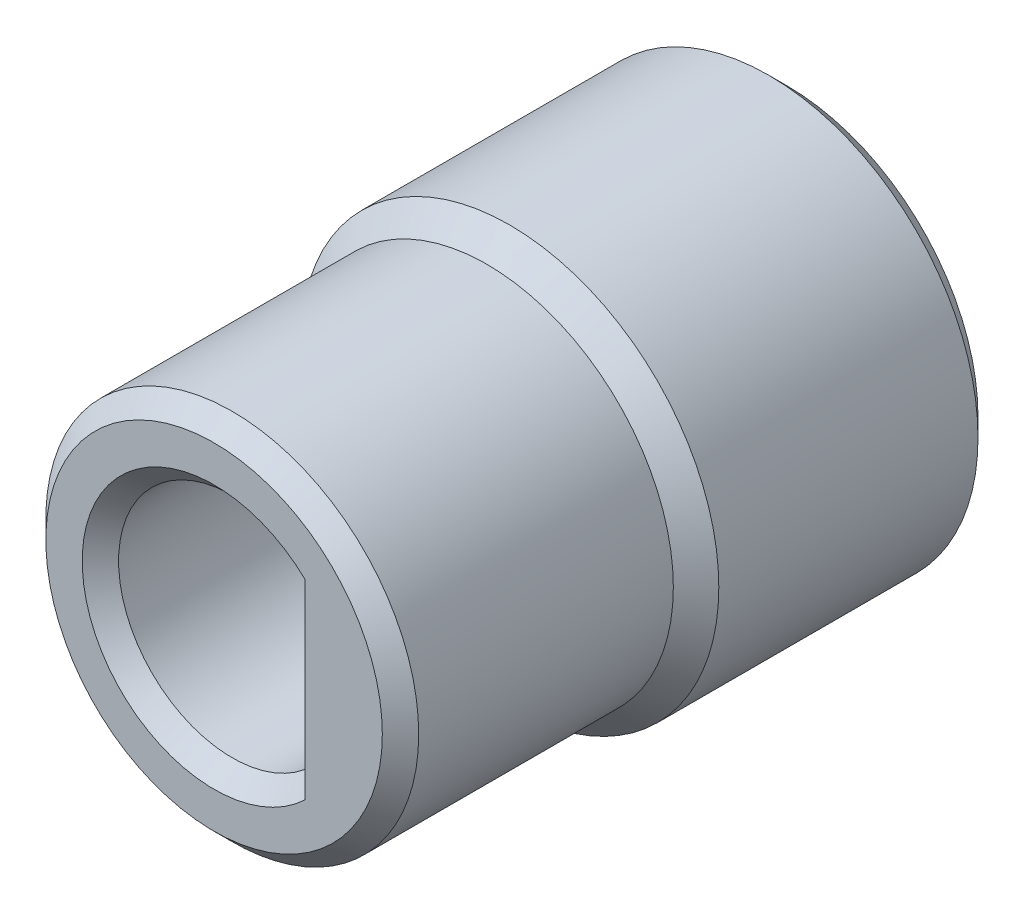
ISO-10303-21;
HEADER;
FILE_DESCRIPTION(('STEP AP214'),'2;1');
FILE_NAME('part.step','',(''),(''),'','','');
FILE_SCHEMA(('AUTOMOTIVE_DESIGN { 1 0 10303 214 1 1 1 1 }'));
ENDSEC;
DATA;
#1=APPLICATION_CONTEXT('core data for automotive mechanical design processes');
#2=APPLICATION_PROTOCOL_DEFINITION('international standard','automotive_design',2000,#1);
#3=PRODUCT_CONTEXT('',#1,'mechanical');
#4=PRODUCT('Part','Part','',(#3));
#5=PRODUCT_RELATED_PRODUCT_CATEGORY('part','',(#4));
#6=PRODUCT_DEFINITION_FORMATION('','',#4);
#7=PRODUCT_DEFINITION_CONTEXT('part definition',#1,'design');
#8=PRODUCT_DEFINITION('design','',#6,#7);
#9=PRODUCT_DEFINITION_SHAPE('','',#8);
#10=(LENGTH_UNIT() NAMED_UNIT(*) SI_UNIT(.MILLI.,.METRE.));
#11=(NAMED_UNIT(*) PLANE_ANGLE_UNIT() SI_UNIT($,.RADIAN.));
#12=(NAMED_UNIT(*) SI_UNIT($,.STERADIAN.) SOLID_ANGLE_UNIT());
#13=UNCERTAINTY_MEASURE_WITH_UNIT(LENGTH_MEASURE(1.E-05),#10,'distance_accuracy_value','');
#14=(GEOMETRIC_REPRESENTATION_CONTEXT(3) GLOBAL_UNCERTAINTY_ASSIGNED_CONTEXT((#13)) GLOBAL_UNIT_ASSIGNED_CONTEXT((#10,
#11,#12)) REPRESENTATION_CONTEXT('',''));
#15=CARTESIAN_POINT('',(0.,0.,0.));
#16=DIRECTION('',(0.,0.,1.));
#17=DIRECTION('',(1.,0.,0.));
#18=AXIS2_PLACEMENT_3D('',#15,#16,#17);
#19=CARTESIAN_POINT('',(0.,0.,0.));
#20=DIRECTION('',(0.,0.,1.));
#21=DIRECTION('',(1.,0.,0.));
#22=AXIS2_PLACEMENT_3D('',#19,#20,#21);
#23=PLANE('',#22);
#24=CARTESIAN_POINT('',(0.,0.,0.));
#25=DIRECTION('',(0.,0.,1.));
#26=DIRECTION('',(1.,0.,0.));
#27=AXIS2_PLACEMENT_3D('',#24,#25,#26);
#28=CIRCLE('',#27,4.2);
#29=CARTESIAN_POINT('',(4.2,0.,0.));
#30=VERTEX_POINT('',#29);
#31=EDGE_CURVE('E237',#30,#30,#28,.F.);
#32=ORIENTED_EDGE('',*,*,#31,.T.);
#33=EDGE_LOOP('',(#32));
#34=FACE_BOUND('',#33,.T.);
#35=CARTESIAN_POINT('',(0.,0.,0.));
#36=DIRECTION('',(0.,0.,1.));
#37=DIRECTION('',(1.,0.,0.));
#38=AXIS2_PLACEMENT_3D('',#35,#36,#37);
#39=CIRCLE('',#38,3.4);
#40=CARTESIAN_POINT('',(-3.4,0.,0.));
#41=VERTEX_POINT('',#40);
#42=EDGE_CURVE('E128',#41,#41,#39,.T.);
#43=ORIENTED_EDGE('',*,*,#42,.T.);
#44=EDGE_LOOP('',(#43));
#45=FACE_BOUND('',#44,.T.);
#46=ADVANCED_FACE('F45',(#34,#45),#23,.F.);
#47=CARTESIAN_POINT('',(0.,0.,6.6));
#48=DIRECTION('',(0.,0.,-1.));
#49=DIRECTION('',(-1.,0.,0.));
#50=AXIS2_PLACEMENT_3D('',#47,#48,#49);
#51=CYLINDRICAL_SURFACE('',#50,4.6);
#52=CARTESIAN_POINT('',(0.,0.,0.399999999999999));
#53=DIRECTION('',(0.,0.,1.));
#54=DIRECTION('',(1.,0.,0.));
#55=AXIS2_PLACEMENT_3D('',#52,#53,#54);
#56=CIRCLE('',#55,4.6);
#57=CARTESIAN_POINT('',(4.6,0.,0.399999999999999));
#58=VERTEX_POINT('',#57);
#59=EDGE_CURVE('E239',#58,#58,#56,.T.);
#60=ORIENTED_EDGE('',*,*,#59,.T.);
#61=EDGE_LOOP('',(#60));
#62=FACE_BOUND('',#61,.T.);
#63=CARTESIAN_POINT('',(0.,0.,6.1));
#64=DIRECTION('',(0.,0.,1.));
#65=DIRECTION('',(1.,0.,0.));
#66=AXIS2_PLACEMENT_3D('',#63,#64,#65);
#67=CIRCLE('',#66,4.6);
#68=CARTESIAN_POINT('',(4.6,0.,6.1));
#69=VERTEX_POINT('',#68);
#70=EDGE_CURVE('E114',#69,#69,#67,.F.);
#71=ORIENTED_EDGE('',*,*,#70,.T.);
#72=EDGE_LOOP('',(#71));
#73=FACE_BOUND('',#72,.T.);
#74=ADVANCED_FACE('F190',(#62,#73),#51,.T.);
#75=CARTESIAN_POINT('',(0.,0.,6.6));
#76=DIRECTION('',(0.,0.,-1.));
#77=DIRECTION('',(-1.,0.,0.));
#78=AXIS2_PLACEMENT_3D('',#75,#76,#77);
#79=CYLINDRICAL_SURFACE('',#78,3.);
#80=CARTESIAN_POINT('',(0.,0.,5.8));
#81=DIRECTION('',(0.,0.,1.));
#82=DIRECTION('',(1.,0.,0.));
#83=AXIS2_PLACEMENT_3D('',#80,#81,#82);
#84=CIRCLE('',#83,3.);
#85=CARTESIAN_POINT('',(-3.,0.,5.8));
#86=VERTEX_POINT('',#85);
#87=EDGE_CURVE('E136',#86,#86,#84,.T.);
#88=CARTESIAN_POINT('',(0.,0.,0.399999999999999));
#89=DIRECTION('',(0.,0.,1.));
#90=DIRECTION('',(1.,0.,0.));
#91=AXIS2_PLACEMENT_3D('',#88,#89,#90);
#92=CIRCLE('',#91,3.);
#93=CARTESIAN_POINT('',(-3.,0.,0.399999999999999));
#94=VERTEX_POINT('',#93);
#95=EDGE_CURVE('E132',#94,#94,#92,.F.);
#96=CARTESIAN_POINT('',(-3.,0.,5.8));
#97=CARTESIAN_POINT('',(-3.,0.,5.74375));
#98=CARTESIAN_POINT('',(-3.,0.,5.6875));
#99=CARTESIAN_POINT('',(-3.,0.,5.575));
#100=CARTESIAN_POINT('',(-3.,0.,5.51875));
#101=CARTESIAN_POINT('',(-3.,0.,5.40625));
#102=CARTESIAN_POINT('',(-3.,0.,5.35));
#103=CARTESIAN_POINT('',(-3.,0.,5.2375));
#104=CARTESIAN_POINT('',(-3.,0.,5.18125));
#105=CARTESIAN_POINT('',(-3.,0.,5.06875));
#106=CARTESIAN_POINT('',(-3.,0.,5.0125));
#107=CARTESIAN_POINT('',(-3.,0.,4.9));
#108=CARTESIAN_POINT('',(-3.,0.,4.84375));
#109=CARTESIAN_POINT('',(-3.,0.,4.73125));
#110=CARTESIAN_POINT('',(-3.,0.,4.675));
#111=CARTESIAN_POINT('',(-3.,0.,4.5625));
#112=CARTESIAN_POINT('',(-3.,0.,4.50625));
#113=CARTESIAN_POINT('',(-3.,0.,4.39375));
#114=CARTESIAN_POINT('',(-3.,0.,4.3375));
#115=CARTESIAN_POINT('',(-3.,0.,4.225));
#116=CARTESIAN_POINT('',(-3.,0.,4.16875));
#117=CARTESIAN_POINT('',(-3.,0.,4.05625));
#118=CARTESIAN_POINT('',(-3.,0.,4.));
#119=CARTESIAN_POINT('',(-3.,0.,3.8875));
#120=CARTESIAN_POINT('',(-3.,0.,3.83125));
#121=CARTESIAN_POINT('',(-3.,0.,3.71875));
#122=CARTESIAN_POINT('',(-3.,0.,3.6625));
#123=CARTESIAN_POINT('',(-3.,0.,3.55));
#124=CARTESIAN_POINT('',(-3.,0.,3.49375));
#125=CARTESIAN_POINT('',(-3.,0.,3.38125));
#126=CARTESIAN_POINT('',(-3.,0.,3.325));
#127=CARTESIAN_POINT('',(-3.,0.,3.2125));
#128=CARTESIAN_POINT('',(-3.,0.,3.15625));
#129=CARTESIAN_POINT('',(-3.,0.,3.04375));
#130=CARTESIAN_POINT('',(-3.,0.,2.9875));
#131=CARTESIAN_POINT('',(-3.,0.,2.875));
#132=CARTESIAN_POINT('',(-3.,0.,2.81875));
#133=CARTESIAN_POINT('',(-3.,0.,2.70625));
#134=CARTESIAN_POINT('',(-3.,0.,2.65));
#135=CARTESIAN_POINT('',(-3.,0.,2.5375));
#136=CARTESIAN_POINT('',(-3.,0.,2.48125));
#137=CARTESIAN_POINT('',(-3.,0.,2.36875));
#138=CARTESIAN_POINT('',(-3.,0.,2.3125));
#139=CARTESIAN_POINT('',(-3.,0.,2.2));
#140=CARTESIAN_POINT('',(-3.,0.,2.14375));
#141=CARTESIAN_POINT('',(-3.,0.,2.03125));
#142=CARTESIAN_POINT('',(-3.,0.,1.975));
#143=CARTESIAN_POINT('',(-3.,0.,1.8625));
#144=CARTESIAN_POINT('',(-3.,0.,1.80625));
#145=CARTESIAN_POINT('',(-3.,0.,1.69375));
#146=CARTESIAN_POINT('',(-3.,0.,1.6375));
#147=CARTESIAN_POINT('',(-3.,0.,1.525));
#148=CARTESIAN_POINT('',(-3.,0.,1.46875));
#149=CARTESIAN_POINT('',(-3.,0.,1.35625));
#150=CARTESIAN_POINT('',(-3.,0.,1.3));
#151=CARTESIAN_POINT('',(-3.,0.,1.1875));
#152=CARTESIAN_POINT('',(-3.,0.,1.13125));
#153=CARTESIAN_POINT('',(-3.,0.,1.01875));
#154=CARTESIAN_POINT('',(-3.,0.,0.962499999999999));
#155=CARTESIAN_POINT('',(-3.,0.,0.85));
#156=CARTESIAN_POINT('',(-3.,0.,0.79375));
#157=CARTESIAN_POINT('',(-3.,0.,0.68125));
#158=CARTESIAN_POINT('',(-3.,0.,0.625));
#159=CARTESIAN_POINT('',(-3.,0.,0.5125));
#160=CARTESIAN_POINT('',(-3.,0.,0.456249999999999));
#161=CARTESIAN_POINT('',(-3.,0.,0.399999999999999));
#162=B_SPLINE_CURVE_WITH_KNOTS('',3,(#96,#97,#98,#99,#100,#101,#102,#103,#104,#105,#106,#107,
#108,#109,#110,#111,#112,#113,#114,#115,#116,#117,#118,#119,#120,#121,#122,#123,#124,#125,#126,
#127,#128,#129,#130,#131,#132,#133,#134,#135,#136,#137,#138,#139,#140,#141,#142,#143,#144,#145,
#146,#147,#148,#149,#150,#151,#152,#153,#154,#155,#156,#157,#158,#159,#160,#161),.UNSPECIFIED.,
.F.,.F.,(4,2,2,2,2,2,2,2,2,2,2,2,2,2,2,2,2,2,2,2,2,2,2,2,2,2,2,2,2,2,2,2,4),(0.,0.16875,
0.337499999999999,0.50625,0.675,0.84375,1.0125,1.18125,1.35,1.51875,1.6875,1.85625,2.025,
2.19375,2.3625,2.53125,2.7,2.86875,3.0375,3.20625,3.375,3.54375,3.7125,3.88125,4.05,4.21875,
4.3875,4.55625,4.725,4.89375,5.0625,5.23125,5.4),.UNSPECIFIED.);
#163=EDGE_CURVE('BSEAM196',#86,#94,#162,.T.);
#164=ORIENTED_EDGE('',*,*,#87,.T.);
#165=ORIENTED_EDGE('',*,*,#95,.T.);
#166=ORIENTED_EDGE('',*,*,#163,.T.);
#167=ORIENTED_EDGE('',*,*,#163,.F.);
#168=EDGE_LOOP('',(#164,#166,#165,#167));
#169=FACE_BOUND('',#168,.T.);
#170=ADVANCED_FACE('F196',(#169),#79,.F.);
#171=CARTESIAN_POINT('',(0.,0.,12.6));
#172=DIRECTION('',(0.,0.,1.));
#173=DIRECTION('',(1.,0.,0.));
#174=AXIS2_PLACEMENT_3D('',#171,#172,#173);
#175=PLANE('',#174);
#176=CARTESIAN_POINT('',(0.,0.,12.6));
#177=DIRECTION('',(0.,0.,1.));
#178=DIRECTION('',(1.,0.,0.));
#179=AXIS2_PLACEMENT_3D('',#176,#177,#178);
#180=CIRCLE('',#179,3.7);
#181=CARTESIAN_POINT('',(3.7,0.,12.6));
#182=VERTEX_POINT('',#181);
#183=EDGE_CURVE('E55',#182,#182,#180,.T.);
#184=ORIENTED_EDGE('',*,*,#183,.T.);
#185=EDGE_LOOP('',(#184));
#186=FACE_BOUND('',#185,.T.);
#187=DIRECTION('',(0.,-1.,0.));
#188=VECTOR('',#187,1.);
#189=CARTESIAN_POINT('',(2.,0.,12.6));
#190=LINE('',#189,#188);
#191=CARTESIAN_POINT('',(2.,2.1,12.6));
#192=VERTEX_POINT('',#191);
#193=CARTESIAN_POINT('',(2.,-2.1,12.6));
#194=VERTEX_POINT('',#193);
#195=EDGE_CURVE('E61',#192,#194,#190,.T.);
#196=ORIENTED_EDGE('',*,*,#195,.T.);
#197=CARTESIAN_POINT('',(0.,0.,12.6));
#198=DIRECTION('',(0.,0.,1.));
#199=DIRECTION('',(1.,0.,0.));
#200=AXIS2_PLACEMENT_3D('',#197,#198,#199);
#201=CIRCLE('',#200,2.9);
#202=EDGE_CURVE('E122',#194,#192,#201,.F.);
#203=ORIENTED_EDGE('',*,*,#202,.T.);
#204=EDGE_LOOP('',(#196,#203));
#205=FACE_BOUND('',#204,.T.);
#206=ADVANCED_FACE('F223',(#186,#205),#175,.T.);
#207=CARTESIAN_POINT('',(0.,0.,6.6));
#208=DIRECTION('',(0.,0.,1.));
#209=DIRECTION('',(1.,0.,0.));
#210=AXIS2_PLACEMENT_3D('',#207,#208,#209);
#211=PLANE('',#210);
#212=CARTESIAN_POINT('',(0.,0.,6.6));
#213=DIRECTION('',(0.,0.,1.));
#214=DIRECTION('',(1.,0.,0.));
#215=AXIS2_PLACEMENT_3D('',#212,#213,#214);
#216=CIRCLE('',#215,2.6);
#217=CARTESIAN_POINT('',(-2.6,0.,6.6));
#218=VERTEX_POINT('',#217);
#219=EDGE_CURVE('E245',#218,#218,#216,.F.);
#220=ORIENTED_EDGE('',*,*,#219,.T.);
#221=EDGE_LOOP('',(#220));
#222=FACE_BOUND('',#221,.T.);
#223=CARTESIAN_POINT('',(0.,0.,6.6));
#224=DIRECTION('',(0.,0.,1.));
#225=DIRECTION('',(1.,0.,0.));
#226=AXIS2_PLACEMENT_3D('',#223,#224,#225);
#227=CIRCLE('',#226,2.5);
#228=CARTESIAN_POINT('',(1.6,1.92093727122986,6.6));
#229=VERTEX_POINT('',#228);
#230=CARTESIAN_POINT('',(1.6,-1.92093727122986,6.6));
#231=VERTEX_POINT('',#230);
#232=EDGE_CURVE('E89',#229,#231,#227,.T.);
#233=ORIENTED_EDGE('',*,*,#232,.T.);
#234=DIRECTION('',(0.,1.,0.));
#235=VECTOR('',#234,1.);
#236=CARTESIAN_POINT('',(1.6,-1.92093727122986,6.6));
#237=LINE('',#236,#235);
#238=EDGE_CURVE('E97',#231,#229,#237,.T.);
#239=ORIENTED_EDGE('',*,*,#238,.T.);
#240=EDGE_LOOP('',(#233,#239));
#241=FACE_BOUND('',#240,.T.);
#242=ADVANCED_FACE('F102',(#222,#241),#211,.F.);
#243=CARTESIAN_POINT('',(0.,0.,12.6));
#244=DIRECTION('',(0.,0.,-1.));
#245=DIRECTION('',(-1.,0.,0.));
#246=AXIS2_PLACEMENT_3D('',#243,#244,#245);
#247=CYLINDRICAL_SURFACE('',#246,4.1);
#248=CARTESIAN_POINT('',(0.,0.,12.2));
#249=DIRECTION('',(0.,0.,1.));
#250=DIRECTION('',(1.,0.,0.));
#251=AXIS2_PLACEMENT_3D('',#248,#249,#250);
#252=CIRCLE('',#251,4.1);
#253=CARTESIAN_POINT('',(4.1,0.,12.2));
#254=VERTEX_POINT('',#253);
#255=EDGE_CURVE('E11',#254,#254,#252,.F.);
#256=ORIENTED_EDGE('',*,*,#255,.T.);
#257=EDGE_LOOP('',(#256));
#258=FACE_BOUND('',#257,.T.);
#259=CARTESIAN_POINT('',(0.,0.,6.6));
#260=DIRECTION('',(0.,0.,1.));
#261=DIRECTION('',(1.,0.,0.));
#262=AXIS2_PLACEMENT_3D('',#259,#260,#261);
#263=CIRCLE('',#262,4.1);
#264=CARTESIAN_POINT('',(4.1,0.,6.6));
#265=VERTEX_POINT('',#264);
#266=EDGE_CURVE('E94',#265,#265,#263,.T.);
#267=ORIENTED_EDGE('',*,*,#266,.T.);
#268=EDGE_LOOP('',(#267));
#269=FACE_BOUND('',#268,.T.);
#270=ADVANCED_FACE('F215',(#258,#269),#247,.T.);
#271=CARTESIAN_POINT('',(0.,0.,12.6));
#272=DIRECTION('',(0.,0.,-1.));
#273=DIRECTION('',(-1.,0.,0.));
#274=AXIS2_PLACEMENT_3D('',#271,#272,#273);
#275=CYLINDRICAL_SURFACE('',#274,2.5);
#276=DIRECTION('',(0.,0.,-1.));
#277=VECTOR('',#276,1.);
#278=CARTESIAN_POINT('',(1.6,1.92093727122986,12.6));
#279=LINE('',#278,#277);
#280=CARTESIAN_POINT('',(1.6,1.92093727122986,12.2));
#281=VERTEX_POINT('',#280);
#282=EDGE_CURVE('E95',#281,#229,#279,.T.);
#283=ORIENTED_EDGE('',*,*,#282,.F.);
#284=CARTESIAN_POINT('',(0.,0.,12.2));
#285=DIRECTION('',(0.,0.,1.));
#286=DIRECTION('',(1.,0.,0.));
#287=AXIS2_PLACEMENT_3D('',#284,#285,#286);
#288=CIRCLE('',#287,2.5);
#289=CARTESIAN_POINT('',(1.6,-1.92093727122986,12.2));
#290=VERTEX_POINT('',#289);
#291=EDGE_CURVE('E91',#281,#290,#288,.T.);
#292=ORIENTED_EDGE('',*,*,#291,.T.);
#293=DIRECTION('',(0.,0.,-1.));
#294=VECTOR('',#293,1.);
#295=CARTESIAN_POINT('',(1.6,-1.92093727122986,12.6));
#296=LINE('',#295,#294);
#297=EDGE_CURVE('E84',#290,#231,#296,.T.);
#298=ORIENTED_EDGE('',*,*,#297,.T.);
#299=ORIENTED_EDGE('',*,*,#232,.F.);
#300=EDGE_LOOP('',(#283,#292,#298,#299));
#301=FACE_BOUND('',#300,.T.);
#302=ADVANCED_FACE('F87',(#301),#275,.F.);
#303=CARTESIAN_POINT('',(1.6,-1.92093727122986,12.6));
#304=DIRECTION('',(-1.,0.,0.));
#305=DIRECTION('',(0.,0.,1.));
#306=AXIS2_PLACEMENT_3D('',#303,#304,#305);
#307=PLANE('',#306);
#308=ORIENTED_EDGE('',*,*,#297,.F.);
#309=DIRECTION('',(0.,1.,0.));
#310=VECTOR('',#309,1.);
#311=CARTESIAN_POINT('',(1.6,-1.92093727122986,12.2));
#312=LINE('',#311,#310);
#313=EDGE_CURVE('E125',#290,#281,#312,.T.);
#314=ORIENTED_EDGE('',*,*,#313,.T.);
#315=ORIENTED_EDGE('',*,*,#282,.T.);
#316=ORIENTED_EDGE('',*,*,#238,.F.);
#317=EDGE_LOOP('',(#308,#314,#315,#316));
#318=FACE_BOUND('',#317,.T.);
#319=ADVANCED_FACE('F98',(#318),#307,.T.);
#320=CARTESIAN_POINT('',(0.,0.,6.6));
#321=DIRECTION('',(0.,0.,-1.));
#322=DIRECTION('',(-1.,0.,0.));
#323=AXIS2_PLACEMENT_3D('',#320,#321,#322);
#324=CONICAL_SURFACE('',#323,4.1,0.785398163397445);
#325=ORIENTED_EDGE('',*,*,#70,.F.);
#326=EDGE_LOOP('',(#325));
#327=FACE_BOUND('',#326,.T.);
#328=ORIENTED_EDGE('',*,*,#266,.F.);
#329=EDGE_LOOP('',(#328));
#330=FACE_BOUND('',#329,.T.);
#331=ADVANCED_FACE('F161',(#327,#330),#324,.T.);
#332=CARTESIAN_POINT('',(1.6,-1.92093727122986,12.2));
#333=DIRECTION('',(0.707106781186546,0.,-0.707106781186549));
#334=DIRECTION('',(0.,1.,0.));
#335=AXIS2_PLACEMENT_3D('',#332,#333,#334);
#336=PLANE('',#335);
#337=CARTESIAN_POINT('',(1.6,-1.92093727122986,12.2));
#338=CARTESIAN_POINT('',(1.66639659829473,-1.95198864238736,12.2663965982947));
#339=CARTESIAN_POINT('',(1.73292833253178,-1.98243626556268,12.3329283325318));
#340=CARTESIAN_POINT('',(1.86626166750856,-2.04212383447698,12.4662616675086));
#341=CARTESIAN_POINT('',(1.93306326660484,-2.07136378755838,12.5330632666048));
#342=CARTESIAN_POINT('',(2.,-2.1,12.6));
#343=B_SPLINE_CURVE_WITH_KNOTS('',3,(#337,#338,#339,#340,#341,#342),.UNSPECIFIED.,.F.,.F.,(4,2,
4),(0.,0.296681663915824,0.593361523796096),.UNSPECIFIED.);
#344=EDGE_CURVE('E106',#194,#290,#343,.F.);
#345=ORIENTED_EDGE('',*,*,#344,.F.);
#346=ORIENTED_EDGE('',*,*,#195,.F.);
#347=CARTESIAN_POINT('',(2.,2.1,12.6));
#348=CARTESIAN_POINT('',(1.93306326660484,2.07136378755838,12.5330632666048));
#349=CARTESIAN_POINT('',(1.86626166750856,2.04212383447698,12.4662616675086));
#350=CARTESIAN_POINT('',(1.73292833253178,1.98243626556268,12.3329283325318));
#351=CARTESIAN_POINT('',(1.66639659829473,1.95198864238736,12.2663965982947));
#352=CARTESIAN_POINT('',(1.6,1.92093727122985,12.2));
#353=B_SPLINE_CURVE_WITH_KNOTS('',3,(#347,#348,#349,#350,#351,#352),.UNSPECIFIED.,.F.,.F.,(4,2,
4),(0.,0.296679859880272,0.593361523796097),.UNSPECIFIED.);
#354=EDGE_CURVE('E68',#281,#192,#353,.F.);
#355=ORIENTED_EDGE('',*,*,#354,.F.);
#356=ORIENTED_EDGE('',*,*,#313,.F.);
#357=EDGE_LOOP('',(#345,#346,#355,#356));
#358=FACE_BOUND('',#357,.T.);
#359=ADVANCED_FACE('F154',(#358),#336,.F.);
#360=CARTESIAN_POINT('',(0.,0.,12.2));
#361=DIRECTION('',(0.,0.,1.));
#362=DIRECTION('',(1.,0.,0.));
#363=AXIS2_PLACEMENT_3D('',#360,#361,#362);
#364=CONICAL_SURFACE('',#363,2.5,0.78539816339745);
#365=ORIENTED_EDGE('',*,*,#354,.T.);
#366=ORIENTED_EDGE('',*,*,#202,.F.);
#367=ORIENTED_EDGE('',*,*,#344,.T.);
#368=ORIENTED_EDGE('',*,*,#291,.F.);
#369=EDGE_LOOP('',(#365,#366,#367,#368));
#370=FACE_BOUND('',#369,.T.);
#371=ADVANCED_FACE('F150',(#370),#364,.F.);
#372=CARTESIAN_POINT('',(0.,0.,0.));
#373=DIRECTION('',(0.,0.,-1.));
#374=DIRECTION('',(-1.,0.,0.));
#375=AXIS2_PLACEMENT_3D('',#372,#373,#374);
#376=CONICAL_SURFACE('',#375,3.4,0.785398163397447);
#377=CARTESIAN_POINT('',(-3.,0.,0.399999999999999));
#378=CARTESIAN_POINT('',(-3.00416666666667,0.,0.395833333333333));
#379=CARTESIAN_POINT('',(-3.00833333333333,0.,0.391666666666666));
#380=CARTESIAN_POINT('',(-3.01666666666667,0.,0.383333333333333));
#381=CARTESIAN_POINT('',(-3.02083333333333,0.,0.379166666666666));
#382=CARTESIAN_POINT('',(-3.02916666666667,0.,0.370833333333333));
#383=CARTESIAN_POINT('',(-3.03333333333333,0.,0.366666666666666));
#384=CARTESIAN_POINT('',(-3.04166666666667,0.,0.358333333333333));
#385=CARTESIAN_POINT('',(-3.04583333333333,0.,0.354166666666666));
#386=CARTESIAN_POINT('',(-3.05416666666667,0.,0.345833333333333));
#387=CARTESIAN_POINT('',(-3.05833333333333,0.,0.341666666666666));
#388=CARTESIAN_POINT('',(-3.06666666666667,0.,0.333333333333333));
#389=CARTESIAN_POINT('',(-3.07083333333333,0.,0.329166666666666));
#390=CARTESIAN_POINT('',(-3.07916666666667,0.,0.320833333333333));
#391=CARTESIAN_POINT('',(-3.08333333333333,0.,0.316666666666666));
#392=CARTESIAN_POINT('',(-3.09166666666667,0.,0.308333333333333));
#393=CARTESIAN_POINT('',(-3.09583333333333,0.,0.304166666666666));
#394=CARTESIAN_POINT('',(-3.10416666666667,0.,0.295833333333333));
#395=CARTESIAN_POINT('',(-3.10833333333333,0.,0.291666666666666));
#396=CARTESIAN_POINT('',(-3.11666666666667,0.,0.283333333333333));
#397=CARTESIAN_POINT('',(-3.12083333333333,0.,0.279166666666666));
#398=CARTESIAN_POINT('',(-3.12916666666667,0.,0.270833333333333));
#399=CARTESIAN_POINT('',(-3.13333333333333,0.,0.266666666666666));
#400=CARTESIAN_POINT('',(-3.14166666666667,0.,0.258333333333333));
#401=CARTESIAN_POINT('',(-3.14583333333333,0.,0.254166666666666));
#402=CARTESIAN_POINT('',(-3.15416666666667,0.,0.245833333333333));
#403=CARTESIAN_POINT('',(-3.15833333333333,0.,0.241666666666666));
#404=CARTESIAN_POINT('',(-3.16666666666667,0.,0.233333333333333));
#405=CARTESIAN_POINT('',(-3.17083333333333,0.,0.229166666666666));
#406=CARTESIAN_POINT('',(-3.17916666666667,0.,0.220833333333333));
#407=CARTESIAN_POINT('',(-3.18333333333333,0.,0.216666666666666));
#408=CARTESIAN_POINT('',(-3.19166666666667,0.,0.208333333333333));
#409=CARTESIAN_POINT('',(-3.19583333333333,0.,0.204166666666666));
#410=CARTESIAN_POINT('',(-3.20416666666667,0.,0.195833333333333));
#411=CARTESIAN_POINT('',(-3.20833333333333,0.,0.191666666666666));
#412=CARTESIAN_POINT('',(-3.21666666666667,0.,0.183333333333333));
#413=CARTESIAN_POINT('',(-3.22083333333333,0.,0.179166666666666));
#414=CARTESIAN_POINT('',(-3.22916666666667,0.,0.170833333333333));
#415=CARTESIAN_POINT('',(-3.23333333333333,0.,0.166666666666666));
#416=CARTESIAN_POINT('',(-3.24166666666667,0.,0.158333333333333));
#417=CARTESIAN_POINT('',(-3.24583333333333,0.,0.154166666666666));
#418=CARTESIAN_POINT('',(-3.25416666666667,0.,0.145833333333333));
#419=CARTESIAN_POINT('',(-3.25833333333333,0.,0.141666666666666));
#420=CARTESIAN_POINT('',(-3.26666666666667,0.,0.133333333333333));
#421=CARTESIAN_POINT('',(-3.27083333333333,0.,0.129166666666666));
#422=CARTESIAN_POINT('',(-3.27916666666667,0.,0.120833333333333));
#423=CARTESIAN_POINT('',(-3.28333333333333,0.,0.116666666666666));
#424=CARTESIAN_POINT('',(-3.29166666666667,0.,0.108333333333333));
#425=CARTESIAN_POINT('',(-3.29583333333333,0.,0.104166666666666));
#426=CARTESIAN_POINT('',(-3.30416666666667,0.,0.0958333333333332));
#427=CARTESIAN_POINT('',(-3.30833333333333,0.,0.0916666666666665));
#428=CARTESIAN_POINT('',(-3.31666666666667,0.,0.0833333333333332));
#429=CARTESIAN_POINT('',(-3.32083333333333,0.,0.0791666666666665));
#430=CARTESIAN_POINT('',(-3.32916666666667,0.,0.0708333333333332));
#431=CARTESIAN_POINT('',(-3.33333333333333,0.,0.0666666666666665));
#432=CARTESIAN_POINT('',(-3.34166666666667,0.,0.0583333333333332));
#433=CARTESIAN_POINT('',(-3.34583333333333,0.,0.0541666666666666));
#434=CARTESIAN_POINT('',(-3.35416666666667,0.,0.0458333333333332));
#435=CARTESIAN_POINT('',(-3.35833333333333,0.,0.0416666666666666));
#436=CARTESIAN_POINT('',(-3.36666666666667,0.,0.0333333333333333));
#437=CARTESIAN_POINT('',(-3.37083333333333,0.,0.0291666666666666));
#438=CARTESIAN_POINT('',(-3.37916666666667,0.,0.0208333333333333));
#439=CARTESIAN_POINT('',(-3.38333333333333,0.,0.0166666666666666));
#440=CARTESIAN_POINT('',(-3.39166666666667,0.,0.00833333333333332));
#441=CARTESIAN_POINT('',(-3.39583333333333,0.,0.00416666666666666));
#442=CARTESIAN_POINT('',(-3.4,0.,0.));
#443=B_SPLINE_CURVE_WITH_KNOTS('',3,(#377,#378,#379,#380,#381,#382,#383,#384,#385,#386,#387,
#388,#389,#390,#391,#392,#393,#394,#395,#396,#397,#398,#399,#400,#401,#402,#403,#404,#405,#406,
#407,#408,#409,#410,#411,#412,#413,#414,#415,#416,#417,#418,#419,#420,#421,#422,#423,#424,#425,
#426,#427,#428,#429,#430,#431,#432,#433,#434,#435,#436,#437,#438,#439,#440,#441,#442),
.UNSPECIFIED.,.F.,.F.,(4,2,2,2,2,2,2,2,2,2,2,2,2,2,2,2,2,2,2,2,2,2,2,2,2,2,2,2,2,2,2,2,4),(0.,
0.0176776695296636,0.0353553390593272,0.0530330085889909,0.0707106781186545,0.0883883476483181,
0.106066017177982,0.123743686707645,0.141421356237309,0.159099025766973,0.176776695296636,
0.1944543648263,0.212132034355963,0.229809703885627,0.247487373415291,0.265165042944954,
0.282842712474618,0.300520382004282,0.318198051533945,0.335875721063609,0.353553390593273,
0.371231060122936,0.3889087296526,0.406586399182263,0.424264068711927,0.441941738241591,
0.459619407771254,0.477297077300918,0.494974746830582,0.512652416360245,0.530330085889909,
0.548007755419572,0.565685424949236),.UNSPECIFIED.);
#444=EDGE_CURVE('BSEAM164',#94,#41,#443,.T.);
#445=ORIENTED_EDGE('',*,*,#95,.F.);
#446=ORIENTED_EDGE('',*,*,#42,.F.);
#447=ORIENTED_EDGE('',*,*,#444,.T.);
#448=ORIENTED_EDGE('',*,*,#444,.F.);
#449=EDGE_LOOP('',(#445,#447,#446,#448));
#450=FACE_BOUND('',#449,.T.);
#451=ADVANCED_FACE('F164',(#450),#376,.F.);
#452=CARTESIAN_POINT('',(0.,0.,5.8));
#453=DIRECTION('',(0.,0.,-1.));
#454=DIRECTION('',(-1.,0.,0.));
#455=AXIS2_PLACEMENT_3D('',#452,#453,#454);
#456=CONICAL_SURFACE('',#455,3.,0.463647609000807);
#457=CARTESIAN_POINT('',(-2.6,0.,6.6));
#458=CARTESIAN_POINT('',(-2.60416666666667,0.,6.59166666666667));
#459=CARTESIAN_POINT('',(-2.60833333333333,0.,6.58333333333333));
#460=CARTESIAN_POINT('',(-2.61666666666667,0.,6.56666666666667));
#461=CARTESIAN_POINT('',(-2.62083333333333,0.,6.55833333333333));
#462=CARTESIAN_POINT('',(-2.62916666666667,0.,6.54166666666667));
#463=CARTESIAN_POINT('',(-2.63333333333333,0.,6.53333333333333));
#464=CARTESIAN_POINT('',(-2.64166666666667,0.,6.51666666666667));
#465=CARTESIAN_POINT('',(-2.64583333333333,0.,6.50833333333333));
#466=CARTESIAN_POINT('',(-2.65416666666667,0.,6.49166666666667));
#467=CARTESIAN_POINT('',(-2.65833333333333,0.,6.48333333333333));
#468=CARTESIAN_POINT('',(-2.66666666666667,0.,6.46666666666667));
#469=CARTESIAN_POINT('',(-2.67083333333333,0.,6.45833333333333));
#470=CARTESIAN_POINT('',(-2.67916666666667,0.,6.44166666666667));
#471=CARTESIAN_POINT('',(-2.68333333333333,0.,6.43333333333333));
#472=CARTESIAN_POINT('',(-2.69166666666667,0.,6.41666666666667));
#473=CARTESIAN_POINT('',(-2.69583333333333,0.,6.40833333333333));
#474=CARTESIAN_POINT('',(-2.70416666666667,0.,6.39166666666667));
#475=CARTESIAN_POINT('',(-2.70833333333333,0.,6.38333333333333));
#476=CARTESIAN_POINT('',(-2.71666666666667,0.,6.36666666666667));
#477=CARTESIAN_POINT('',(-2.72083333333333,0.,6.35833333333333));
#478=CARTESIAN_POINT('',(-2.72916666666667,0.,6.34166666666667));
#479=CARTESIAN_POINT('',(-2.73333333333333,0.,6.33333333333333));
#480=CARTESIAN_POINT('',(-2.74166666666667,0.,6.31666666666667));
#481=CARTESIAN_POINT('',(-2.74583333333333,0.,6.30833333333333));
#482=CARTESIAN_POINT('',(-2.75416666666667,0.,6.29166666666667));
#483=CARTESIAN_POINT('',(-2.75833333333333,0.,6.28333333333333));
#484=CARTESIAN_POINT('',(-2.76666666666667,0.,6.26666666666667));
#485=CARTESIAN_POINT('',(-2.77083333333333,0.,6.25833333333333));
#486=CARTESIAN_POINT('',(-2.77916666666667,0.,6.24166666666667));
#487=CARTESIAN_POINT('',(-2.78333333333333,0.,6.23333333333333));
#488=CARTESIAN_POINT('',(-2.79166666666667,0.,6.21666666666667));
#489=CARTESIAN_POINT('',(-2.79583333333333,0.,6.20833333333333));
#490=CARTESIAN_POINT('',(-2.80416666666667,0.,6.19166666666667));
#491=CARTESIAN_POINT('',(-2.80833333333333,0.,6.18333333333333));
#492=CARTESIAN_POINT('',(-2.81666666666667,0.,6.16666666666667));
#493=CARTESIAN_POINT('',(-2.82083333333333,0.,6.15833333333333));
#494=CARTESIAN_POINT('',(-2.82916666666667,0.,6.14166666666667));
#495=CARTESIAN_POINT('',(-2.83333333333333,0.,6.13333333333333));
#496=CARTESIAN_POINT('',(-2.84166666666667,0.,6.11666666666667));
#497=CARTESIAN_POINT('',(-2.84583333333333,0.,6.10833333333333));
#498=CARTESIAN_POINT('',(-2.85416666666667,0.,6.09166666666667));
#499=CARTESIAN_POINT('',(-2.85833333333333,0.,6.08333333333333));
#500=CARTESIAN_POINT('',(-2.86666666666667,0.,6.06666666666667));
#501=CARTESIAN_POINT('',(-2.87083333333333,0.,6.05833333333333));
#502=CARTESIAN_POINT('',(-2.87916666666667,0.,6.04166666666667));
#503=CARTESIAN_POINT('',(-2.88333333333333,0.,6.03333333333333));
#504=CARTESIAN_POINT('',(-2.89166666666667,0.,6.01666666666667));
#505=CARTESIAN_POINT('',(-2.89583333333333,0.,6.00833333333333));
#506=CARTESIAN_POINT('',(-2.90416666666667,0.,5.99166666666667));
#507=CARTESIAN_POINT('',(-2.90833333333333,0.,5.98333333333333));
#508=CARTESIAN_POINT('',(-2.91666666666667,0.,5.96666666666667));
#509=CARTESIAN_POINT('',(-2.92083333333333,0.,5.95833333333333));
#510=CARTESIAN_POINT('',(-2.92916666666667,0.,5.94166666666667));
#511=CARTESIAN_POINT('',(-2.93333333333333,0.,5.93333333333333));
#512=CARTESIAN_POINT('',(-2.94166666666667,0.,5.91666666666667));
#513=CARTESIAN_POINT('',(-2.94583333333333,0.,5.90833333333333));
#514=CARTESIAN_POINT('',(-2.95416666666667,0.,5.89166666666667));
#515=CARTESIAN_POINT('',(-2.95833333333333,0.,5.88333333333333));
#516=CARTESIAN_POINT('',(-2.96666666666667,0.,5.86666666666667));
#517=CARTESIAN_POINT('',(-2.97083333333333,0.,5.85833333333334));
#518=CARTESIAN_POINT('',(-2.97916666666667,0.,5.84166666666667));
#519=CARTESIAN_POINT('',(-2.98333333333333,0.,5.83333333333334));
#520=CARTESIAN_POINT('',(-2.99166666666667,0.,5.81666666666667));
#521=CARTESIAN_POINT('',(-2.99583333333333,0.,5.80833333333334));
#522=CARTESIAN_POINT('',(-3.,0.,5.8));
#523=B_SPLINE_CURVE_WITH_KNOTS('',3,(#457,#458,#459,#460,#461,#462,#463,#464,#465,#466,#467,
#468,#469,#470,#471,#472,#473,#474,#475,#476,#477,#478,#479,#480,#481,#482,#483,#484,#485,#486,
#487,#488,#489,#490,#491,#492,#493,#494,#495,#496,#497,#498,#499,#500,#501,#502,#503,#504,#505,
#506,#507,#508,#509,#510,#511,#512,#513,#514,#515,#516,#517,#518,#519,#520,#521,#522),
.UNSPECIFIED.,.F.,.F.,(4,2,2,2,2,2,2,2,2,2,2,2,2,2,2,2,2,2,2,2,2,2,2,2,2,2,2,2,2,2,2,2,4),(0.,
0.0279508497187474,0.0559016994374946,0.0838525491562418,0.111803398874989,0.139754248593736,
0.167705098312483,0.195655948031231,0.223606797749978,0.251557647468725,0.279508497187473,
0.30745934690622,0.335410196624968,0.363361046343715,0.391311896062462,0.419262745781209,
0.447213595499957,0.475164445218704,0.503115294937451,0.531066144656198,0.559016994374946,
0.586967844093694,0.614918693812441,0.642869543531188,0.670820393249935,0.698771242968682,
0.72672209268743,0.754672942406177,0.782623792124924,0.810574641843671,0.838525491562418,
0.866476341281166,0.894427190999913),.UNSPECIFIED.);
#524=EDGE_CURVE('BSEAM171',#218,#86,#523,.T.);
#525=ORIENTED_EDGE('',*,*,#219,.F.);
#526=ORIENTED_EDGE('',*,*,#87,.F.);
#527=ORIENTED_EDGE('',*,*,#524,.T.);
#528=ORIENTED_EDGE('',*,*,#524,.F.);
#529=EDGE_LOOP('',(#525,#527,#526,#528));
#530=FACE_BOUND('',#529,.T.);
#531=ADVANCED_FACE('F171',(#530),#456,.F.);
#532=CARTESIAN_POINT('',(0.,0.,0.399999999999999));
#533=DIRECTION('',(0.,0.,1.));
#534=DIRECTION('',(1.,0.,0.));
#535=AXIS2_PLACEMENT_3D('',#532,#533,#534);
#536=CONICAL_SURFACE('',#535,4.6,0.785398163397448);
#537=CARTESIAN_POINT('',(4.2,0.,0.));
#538=CARTESIAN_POINT('',(4.20416666666667,0.,0.00416666666666671));
#539=CARTESIAN_POINT('',(4.20833333333333,0.,0.00833333333333335));
#540=CARTESIAN_POINT('',(4.21666666666667,0.,0.0166666666666666));
#541=CARTESIAN_POINT('',(4.22083333333333,0.,0.0208333333333333));
#542=CARTESIAN_POINT('',(4.22916666666667,0.,0.0291666666666665));
#543=CARTESIAN_POINT('',(4.23333333333333,0.,0.0333333333333331));
#544=CARTESIAN_POINT('',(4.24166666666667,0.,0.0416666666666665));
#545=CARTESIAN_POINT('',(4.24583333333333,0.,0.0458333333333333));
#546=CARTESIAN_POINT('',(4.25416666666667,0.,0.0541666666666666));
#547=CARTESIAN_POINT('',(4.25833333333333,0.,0.0583333333333331));
#548=CARTESIAN_POINT('',(4.26666666666667,0.,0.0666666666666664));
#549=CARTESIAN_POINT('',(4.27083333333333,0.,0.0708333333333332));
#550=CARTESIAN_POINT('',(4.27916666666667,0.,0.0791666666666666));
#551=CARTESIAN_POINT('',(4.28333333333333,0.,0.0833333333333331));
#552=CARTESIAN_POINT('',(4.29166666666667,0.,0.0916666666666664));
#553=CARTESIAN_POINT('',(4.29583333333333,0.,0.0958333333333332));
#554=CARTESIAN_POINT('',(4.30416666666667,0.,0.104166666666667));
#555=CARTESIAN_POINT('',(4.30833333333333,0.,0.108333333333333));
#556=CARTESIAN_POINT('',(4.31666666666667,0.,0.116666666666666));
#557=CARTESIAN_POINT('',(4.32083333333333,0.,0.120833333333333));
#558=CARTESIAN_POINT('',(4.32916666666667,0.,0.129166666666666));
#559=CARTESIAN_POINT('',(4.33333333333333,0.,0.133333333333333));
#560=CARTESIAN_POINT('',(4.34166666666667,0.,0.141666666666666));
#561=CARTESIAN_POINT('',(4.34583333333333,0.,0.145833333333333));
#562=CARTESIAN_POINT('',(4.35416666666667,0.,0.154166666666666));
#563=CARTESIAN_POINT('',(4.35833333333333,0.,0.158333333333333));
#564=CARTESIAN_POINT('',(4.36666666666667,0.,0.166666666666666));
#565=CARTESIAN_POINT('',(4.37083333333333,0.,0.170833333333333));
#566=CARTESIAN_POINT('',(4.37916666666667,0.,0.179166666666666));
#567=CARTESIAN_POINT('',(4.38333333333333,0.,0.183333333333333));
#568=CARTESIAN_POINT('',(4.39166666666667,0.,0.191666666666666));
#569=CARTESIAN_POINT('',(4.39583333333333,0.,0.195833333333333));
#570=CARTESIAN_POINT('',(4.40416666666667,0.,0.204166666666666));
#571=CARTESIAN_POINT('',(4.40833333333333,0.,0.208333333333333));
#572=CARTESIAN_POINT('',(4.41666666666667,0.,0.216666666666666));
#573=CARTESIAN_POINT('',(4.42083333333333,0.,0.220833333333333));
#574=CARTESIAN_POINT('',(4.42916666666667,0.,0.229166666666666));
#575=CARTESIAN_POINT('',(4.43333333333333,0.,0.233333333333333));
#576=CARTESIAN_POINT('',(4.44166666666667,0.,0.241666666666666));
#577=CARTESIAN_POINT('',(4.44583333333333,0.,0.245833333333333));
#578=CARTESIAN_POINT('',(4.45416666666667,0.,0.254166666666666));
#579=CARTESIAN_POINT('',(4.45833333333333,0.,0.258333333333333));
#580=CARTESIAN_POINT('',(4.46666666666667,0.,0.266666666666666));
#581=CARTESIAN_POINT('',(4.47083333333333,0.,0.270833333333333));
#582=CARTESIAN_POINT('',(4.47916666666667,0.,0.279166666666666));
#583=CARTESIAN_POINT('',(4.48333333333333,0.,0.283333333333333));
#584=CARTESIAN_POINT('',(4.49166666666667,0.,0.291666666666666));
#585=CARTESIAN_POINT('',(4.49583333333333,0.,0.295833333333333));
#586=CARTESIAN_POINT('',(4.50416666666667,0.,0.304166666666666));
#587=CARTESIAN_POINT('',(4.50833333333333,0.,0.308333333333333));
#588=CARTESIAN_POINT('',(4.51666666666667,0.,0.316666666666666));
#589=CARTESIAN_POINT('',(4.52083333333333,0.,0.320833333333333));
#590=CARTESIAN_POINT('',(4.52916666666667,0.,0.329166666666666));
#591=CARTESIAN_POINT('',(4.53333333333333,0.,0.333333333333333));
#592=CARTESIAN_POINT('',(4.54166666666667,0.,0.341666666666666));
#593=CARTESIAN_POINT('',(4.54583333333333,0.,0.345833333333333));
#594=CARTESIAN_POINT('',(4.55416666666667,0.,0.354166666666666));
#595=CARTESIAN_POINT('',(4.55833333333333,0.,0.358333333333333));
#596=CARTESIAN_POINT('',(4.56666666666667,0.,0.366666666666666));
#597=CARTESIAN_POINT('',(4.57083333333333,0.,0.370833333333333));
#598=CARTESIAN_POINT('',(4.57916666666667,0.,0.379166666666666));
#599=CARTESIAN_POINT('',(4.58333333333333,0.,0.383333333333333));
#600=CARTESIAN_POINT('',(4.59166666666667,0.,0.391666666666666));
#601=CARTESIAN_POINT('',(4.59583333333333,0.,0.395833333333333));
#602=CARTESIAN_POINT('',(4.6,0.,0.399999999999999));
#603=B_SPLINE_CURVE_WITH_KNOTS('',3,(#537,#538,#539,#540,#541,#542,#543,#544,#545,#546,#547,
#548,#549,#550,#551,#552,#553,#554,#555,#556,#557,#558,#559,#560,#561,#562,#563,#564,#565,#566,
#567,#568,#569,#570,#571,#572,#573,#574,#575,#576,#577,#578,#579,#580,#581,#582,#583,#584,#585,
#586,#587,#588,#589,#590,#591,#592,#593,#594,#595,#596,#597,#598,#599,#600,#601,#602),
.UNSPECIFIED.,.F.,.F.,(4,2,2,2,2,2,2,2,2,2,2,2,2,2,2,2,2,2,2,2,2,2,2,2,2,2,2,2,2,2,2,2,4),(0.,
0.0176776695296633,0.0353553390593272,0.0530330085889912,0.0707106781186545,0.0883883476483184,
0.106066017177982,0.123743686707646,0.141421356237309,0.159099025766973,0.176776695296637,
0.1944543648263,0.212132034355964,0.229809703885627,0.247487373415291,0.265165042944955,
0.282842712474619,0.300520382004282,0.318198051533946,0.33587572106361,0.353553390593273,
0.371231060122937,0.3889087296526,0.406586399182264,0.424264068711928,0.441941738241591,
0.459619407771255,0.477297077300919,0.494974746830583,0.512652416360246,0.53033008588991,
0.548007755419573,0.565685424949237),.UNSPECIFIED.);
#604=EDGE_CURVE('BSEAM177',#30,#58,#603,.T.);
#605=ORIENTED_EDGE('',*,*,#31,.F.);
#606=ORIENTED_EDGE('',*,*,#59,.F.);
#607=ORIENTED_EDGE('',*,*,#604,.T.);
#608=ORIENTED_EDGE('',*,*,#604,.F.);
#609=EDGE_LOOP('',(#605,#607,#606,#608));
#610=FACE_BOUND('',#609,.T.);
#611=ADVANCED_FACE('F177',(#610),#536,.T.);
#612=CARTESIAN_POINT('',(0.,0.,12.6));
#613=DIRECTION('',(0.,0.,-1.));
#614=DIRECTION('',(-1.,0.,0.));
#615=AXIS2_PLACEMENT_3D('',#612,#613,#614);
#616=CONICAL_SURFACE('',#615,3.7,0.785398163397448);
#617=ORIENTED_EDGE('',*,*,#255,.F.);
#618=EDGE_LOOP('',(#617));
#619=FACE_BOUND('',#618,.T.);
#620=ORIENTED_EDGE('',*,*,#183,.F.);
#621=EDGE_LOOP('',(#620));
#622=FACE_BOUND('',#621,.T.);
#623=ADVANCED_FACE('F48',(#619,#622),#616,.T.);
#624=CLOSED_SHELL('',(#46,#74,#170,#206,#242,#270,#302,#319,#331,#359,#371,#451,#531,#611,#623));
#625=MANIFOLD_SOLID_BREP('B2',#624);
#626=ADVANCED_BREP_SHAPE_REPRESENTATION('',(#18,#625),#14);
#627=SHAPE_DEFINITION_REPRESENTATION(#9,#626);
ENDSEC;
END-ISO-10303-21;
